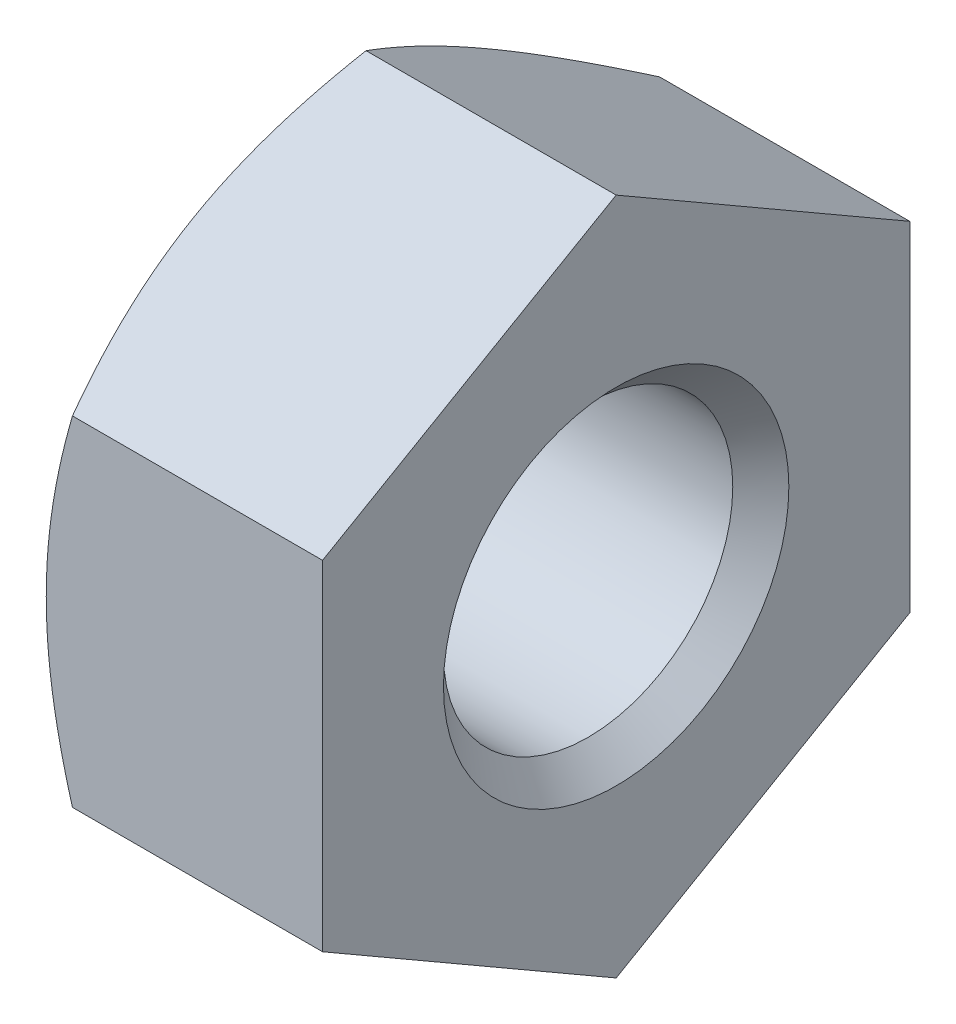
ISO-10303-21;
HEADER;
FILE_DESCRIPTION(('STEP AP214'),'2;1');
FILE_NAME('part.step','',(''),(''),'','','');
FILE_SCHEMA(('AUTOMOTIVE_DESIGN { 1 0 10303 214 1 1 1 1 }'));
ENDSEC;
DATA;
#1=APPLICATION_CONTEXT('core data for automotive mechanical design processes');
#2=APPLICATION_PROTOCOL_DEFINITION('international standard','automotive_design',2000,#1);
#3=PRODUCT_CONTEXT('',#1,'mechanical');
#4=PRODUCT('Part','Part','',(#3));
#5=PRODUCT_RELATED_PRODUCT_CATEGORY('part','',(#4));
#6=PRODUCT_DEFINITION_FORMATION('','',#4);
#7=PRODUCT_DEFINITION_CONTEXT('part definition',#1,'design');
#8=PRODUCT_DEFINITION('design','',#6,#7);
#9=PRODUCT_DEFINITION_SHAPE('','',#8);
#10=(LENGTH_UNIT() NAMED_UNIT(*) SI_UNIT(.MILLI.,.METRE.));
#11=(NAMED_UNIT(*) PLANE_ANGLE_UNIT() SI_UNIT($,.RADIAN.));
#12=(NAMED_UNIT(*) SI_UNIT($,.STERADIAN.) SOLID_ANGLE_UNIT());
#13=UNCERTAINTY_MEASURE_WITH_UNIT(LENGTH_MEASURE(1.E-05),#10,'distance_accuracy_value','');
#14=(GEOMETRIC_REPRESENTATION_CONTEXT(3) GLOBAL_UNCERTAINTY_ASSIGNED_CONTEXT((#13)) GLOBAL_UNIT_ASSIGNED_CONTEXT((#10,
#11,#12)) REPRESENTATION_CONTEXT('',''));
#15=CARTESIAN_POINT('',(0.,0.,0.));
#16=DIRECTION('',(0.,0.,1.));
#17=DIRECTION('',(1.,0.,0.));
#18=AXIS2_PLACEMENT_3D('',#15,#16,#17);
#19=CARTESIAN_POINT('',(0.,0.,0.));
#20=DIRECTION('',(-1.,0.,0.));
#21=DIRECTION('',(0.,0.,1.));
#22=AXIS2_PLACEMENT_3D('',#19,#20,#21);
#23=CONICAL_SURFACE('',#22,5.0000000000523,0.785398163397448);
#24=CARTESIAN_POINT('',(0.,0.,0.));
#25=DIRECTION('',(-1.,0.,0.));
#26=DIRECTION('',(0.,0.,1.));
#27=AXIS2_PLACEMENT_3D('',#24,#25,#26);
#28=CIRCLE('',#27,5.0000000000523);
#29=CARTESIAN_POINT('',(0.,0.,5.0000000000523));
#30=VERTEX_POINT('',#29);
#31=EDGE_CURVE('E21',#30,#30,#28,.T.);
#32=ORIENTED_EDGE('',*,*,#31,.T.);
#33=EDGE_LOOP('',(#32));
#34=FACE_BOUND('',#33,.T.);
#35=CARTESIAN_POINT('',(0.811999999999993,0.,0.));
#36=DIRECTION('',(-1.,0.,0.));
#37=DIRECTION('',(0.,0.,1.));
#38=AXIS2_PLACEMENT_3D('',#35,#36,#37);
#39=CIRCLE('',#38,4.188);
#40=CARTESIAN_POINT('',(0.811999999999993,0.,4.188));
#41=VERTEX_POINT('',#40);
#42=EDGE_CURVE('E106',#41,#41,#39,.F.);
#43=ORIENTED_EDGE('',*,*,#42,.T.);
#44=EDGE_LOOP('',(#43));
#45=FACE_BOUND('',#44,.T.);
#46=ADVANCED_FACE('F18',(#34,#45),#23,.F.);
#47=CARTESIAN_POINT('',(0.,0.,0.));
#48=DIRECTION('',(1.,0.,0.));
#49=DIRECTION('',(0.,0.,-1.));
#50=AXIS2_PLACEMENT_3D('',#47,#48,#49);
#51=PLANE('',#50);
#52=ORIENTED_EDGE('',*,*,#31,.F.);
#53=EDGE_LOOP('',(#52));
#54=FACE_BOUND('',#53,.T.);
#55=CARTESIAN_POINT('',(0.,0.,0.));
#56=DIRECTION('',(1.,0.,0.));
#57=DIRECTION('',(0.,1.,0.));
#58=AXIS2_PLACEMENT_3D('',#55,#56,#57);
#59=CIRCLE('',#58,8.5);
#60=CARTESIAN_POINT('',(0.,0.,-8.49999999999995));
#61=VERTEX_POINT('',#60);
#62=CARTESIAN_POINT('',(0.,7.36121593216772,-4.25000000000009));
#63=VERTEX_POINT('',#62);
#64=EDGE_CURVE('E102',#61,#63,#59,.T.);
#65=ORIENTED_EDGE('',*,*,#64,.F.);
#66=CARTESIAN_POINT('',(0.,0.,0.));
#67=DIRECTION('',(1.,0.,0.));
#68=DIRECTION('',(0.,1.,0.));
#69=AXIS2_PLACEMENT_3D('',#66,#67,#68);
#70=CIRCLE('',#69,8.5);
#71=CARTESIAN_POINT('',(0.,-7.36121593216774,-4.25000000000009));
#72=VERTEX_POINT('',#71);
#73=EDGE_CURVE('E96',#72,#61,#70,.T.);
#74=ORIENTED_EDGE('',*,*,#73,.F.);
#75=CARTESIAN_POINT('',(0.,0.,0.));
#76=DIRECTION('',(1.,0.,0.));
#77=DIRECTION('',(0.,1.,0.));
#78=AXIS2_PLACEMENT_3D('',#75,#76,#77);
#79=CIRCLE('',#78,8.5);
#80=CARTESIAN_POINT('',(0.,-7.36121593216774,4.25000000000009));
#81=VERTEX_POINT('',#80);
#82=EDGE_CURVE('E85',#81,#72,#79,.T.);
#83=ORIENTED_EDGE('',*,*,#82,.F.);
#84=CARTESIAN_POINT('',(0.,0.,0.));
#85=DIRECTION('',(1.,0.,0.));
#86=DIRECTION('',(0.,1.,0.));
#87=AXIS2_PLACEMENT_3D('',#84,#85,#86);
#88=CIRCLE('',#87,8.5);
#89=CARTESIAN_POINT('',(0.,0.,8.49999999999995));
#90=VERTEX_POINT('',#89);
#91=EDGE_CURVE('E95',#90,#81,#88,.T.);
#92=ORIENTED_EDGE('',*,*,#91,.F.);
#93=CARTESIAN_POINT('',(0.,0.,0.));
#94=DIRECTION('',(1.,0.,0.));
#95=DIRECTION('',(0.,1.,0.));
#96=AXIS2_PLACEMENT_3D('',#93,#94,#95);
#97=CIRCLE('',#96,8.5);
#98=CARTESIAN_POINT('',(0.,7.36121593216774,4.25000000000009));
#99=VERTEX_POINT('',#98);
#100=EDGE_CURVE('E447',#99,#90,#97,.T.);
#101=ORIENTED_EDGE('',*,*,#100,.F.);
#102=CARTESIAN_POINT('',(0.,0.,0.));
#103=DIRECTION('',(1.,0.,0.));
#104=DIRECTION('',(0.,1.,0.));
#105=AXIS2_PLACEMENT_3D('',#102,#103,#104);
#106=CIRCLE('',#105,8.5);
#107=EDGE_CURVE('E449',#63,#99,#106,.T.);
#108=ORIENTED_EDGE('',*,*,#107,.F.);
#109=EDGE_LOOP('',(#65,#74,#83,#92,#101,#108));
#110=FACE_BOUND('',#109,.T.);
#111=ADVANCED_FACE('F100',(#54,#110),#51,.F.);
#112=CARTESIAN_POINT('',(7.99999999999999,0.,0.));
#113=DIRECTION('',(-1.,0.,0.));
#114=DIRECTION('',(0.,0.,1.));
#115=AXIS2_PLACEMENT_3D('',#112,#113,#114);
#116=CYLINDRICAL_SURFACE('',#115,4.188);
#117=ORIENTED_EDGE('',*,*,#42,.F.);
#118=EDGE_LOOP('',(#117));
#119=FACE_BOUND('',#118,.T.);
#120=CARTESIAN_POINT('',(7.18800000004194,0.,0.));
#121=DIRECTION('',(1.,0.,0.));
#122=DIRECTION('',(0.,0.,-1.));
#123=AXIS2_PLACEMENT_3D('',#120,#121,#122);
#124=CIRCLE('',#123,4.18799999999919);
#125=CARTESIAN_POINT('',(7.18800000004194,0.,-4.18799999999919));
#126=VERTEX_POINT('',#125);
#127=EDGE_CURVE('E245',#126,#126,#124,.T.);
#128=ORIENTED_EDGE('',*,*,#127,.T.);
#129=EDGE_LOOP('',(#128));
#130=FACE_BOUND('',#129,.T.);
#131=ADVANCED_FACE('F142',(#119,#130),#116,.F.);
#132=CARTESIAN_POINT('',(0.763744514826178,0.,0.));
#133=DIRECTION('',(1.,0.,0.));
#134=DIRECTION('',(0.,1.,0.));
#135=AXIS2_PLACEMENT_3D('',#132,#133,#134);
#136=CONICAL_SURFACE('',#135,9.82284430368098,1.0471975511966);
#137=CARTESIAN_POINT('',(0.,0.,-8.49999999999995));
#138=CARTESIAN_POINT('',(-3.4739183276009E-05,-0.208294880355984,-8.49999999999995));
#139=CARTESIAN_POINT('',(0.00441964379697437,-0.416579726441358,-8.49999999999995));
#140=CARTESIAN_POINT('',(0.022048454738057,-0.832740448360074,-8.49999999999995));
#141=CARTESIAN_POINT('',(0.0352211564053273,-1.04061639698708,-8.49999999999995));
#142=CARTESIAN_POINT('',(0.0699416637352316,-1.4546166103346,-8.49999999999995));
#143=CARTESIAN_POINT('',(0.0914473072514179,-1.66074443821211,-8.49999999999995));
#144=CARTESIAN_POINT('',(0.142371103659139,-2.07201802968812,-8.49999999999995));
#145=CARTESIAN_POINT('',(0.171789464819417,-2.27716376729257,-8.49999999999995));
#146=CARTESIAN_POINT('',(0.271004814168306,-2.89027749857134,-8.49999999999995));
#147=CARTESIAN_POINT('',(0.351810244411298,-3.2964643738834,-8.49999999999995));
#148=CARTESIAN_POINT('',(0.538168234472158,-4.10534509574867,-8.49999999999995));
#149=CARTESIAN_POINT('',(0.643844385729239,-4.50801072781286,-8.49999999999995));
#150=CARTESIAN_POINT('',(0.759189378554848,-4.90747728811182,-8.49999999999995));
#151=B_SPLINE_CURVE_WITH_KNOTS('',3,(#137,#138,#139,#140,#141,#142,#143,#144,#145,#146,#147,
#148,#149,#150),.UNSPECIFIED.,.F.,.F.,(4,2,2,2,2,2,4),(0.,0.624820870450639,1.24951805860457,
1.87109489585109,2.4926880950737,3.73424531091525,4.9821076301794),.UNSPECIFIED.);
#152=CARTESIAN_POINT('',(0.759189378554848,-4.90747728811182,-8.49999999999995));
#153=VERTEX_POINT('',#152);
#154=EDGE_CURVE('E117',#61,#153,#151,.T.);
#155=ORIENTED_EDGE('',*,*,#154,.T.);
#156=CARTESIAN_POINT('',(0.759189378554848,-4.90747728811182,-8.49999999999995));
#157=CARTESIAN_POINT('',(0.64384438572925,-5.10721056826131,-8.15405181081868));
#158=CARTESIAN_POINT('',(0.538168234472175,-5.30854338429341,-7.80533314422018));
#159=CARTESIAN_POINT('',(0.351810244411324,-5.71298374522604,-7.10482189045339));
#160=CARTESIAN_POINT('',(0.271004814168335,-5.91607718288206,-6.75305373774933));
#161=CARTESIAN_POINT('',(0.171789464819448,-6.22263404852144,-6.22208167105285));
#162=CARTESIAN_POINT('',(0.142371103659171,-6.32520691732366,-6.0444202508093));
#163=CARTESIAN_POINT('',(0.0914473072514496,-6.53084371306166,-5.68824687268543));
#164=CARTESIAN_POINT('',(0.0699416637352622,-6.63390762700042,-5.5097349373166));
#165=CARTESIAN_POINT('',(0.0352211564053588,-6.84090773367417,-5.15120023538548));
#166=CARTESIAN_POINT('',(0.0220484547380906,-6.94484570798766,-4.97117438303871));
#167=CARTESIAN_POINT('',(0.0044196437970021,-7.15292606894703,-4.61076862579984));
#168=CARTESIAN_POINT('',(-3.47391832562963E-05,-7.25706849198972,-4.43038865786659));
#169=CARTESIAN_POINT('',(0.,-7.36121593216774,-4.25000000000009));
#170=B_SPLINE_CURVE_WITH_KNOTS('',3,(#156,#157,#158,#159,#160,#161,#162,#163,#164,#165,#166,
#167,#168,#169),.UNSPECIFIED.,.F.,.F.,(4,2,2,2,2,2,4),(0.,1.24786231926412,2.48941953510564,
3.11101273432823,3.73258957157474,4.35728675972866,4.98210763017928),.UNSPECIFIED.);
#171=EDGE_CURVE('E111',#153,#72,#170,.T.);
#172=ORIENTED_EDGE('',*,*,#171,.T.);
#173=ORIENTED_EDGE('',*,*,#73,.T.);
#174=EDGE_LOOP('',(#155,#172,#173));
#175=FACE_BOUND('',#174,.T.);
#176=ADVANCED_FACE('F116',(#175),#136,.T.);
#177=CARTESIAN_POINT('',(0.763744514826178,0.,0.));
#178=DIRECTION('',(1.,0.,0.));
#179=DIRECTION('',(0.,1.,0.));
#180=AXIS2_PLACEMENT_3D('',#177,#178,#179);
#181=CONICAL_SURFACE('',#180,9.82284430368098,1.0471975511966);
#182=CARTESIAN_POINT('',(0.,-7.36121593216774,-4.25000000000009));
#183=CARTESIAN_POINT('',(-3.47391832595689E-05,-7.4653633723457,-4.06961134213355));
#184=CARTESIAN_POINT('',(0.00441964379699695,-7.56950579538838,-3.88923137420027));
#185=CARTESIAN_POINT('',(0.0220484547380831,-7.77758615634773,-3.52882561696138));
#186=CARTESIAN_POINT('',(0.0352211564053507,-7.88152413066124,-3.34879976461461));
#187=CARTESIAN_POINT('',(0.069941663735253,-8.088524237335,-2.99026506268348));
#188=CARTESIAN_POINT('',(0.0914473072514398,-8.19158815127376,-2.81175312731464));
#189=CARTESIAN_POINT('',(0.14237110365916,-8.39722494701176,-2.45557974919075));
#190=CARTESIAN_POINT('',(0.171789464819437,-8.49979781581399,-2.2779183289472));
#191=CARTESIAN_POINT('',(0.271004814168326,-8.80635468145338,-1.74694626225071));
#192=CARTESIAN_POINT('',(0.351810244411319,-9.00944811910942,-1.39517810954663));
#193=CARTESIAN_POINT('',(0.538168234472175,-9.41388848004206,-0.694666855779807));
#194=CARTESIAN_POINT('',(0.643844385729251,-9.61522129607416,-0.345948189181293));
#195=CARTESIAN_POINT('',(0.759189378554848,-9.81495457622364,0.));
#196=B_SPLINE_CURVE_WITH_KNOTS('',3,(#182,#183,#184,#185,#186,#187,#188,#189,#190,#191,#192,
#193,#194,#195),.UNSPECIFIED.,.F.,.F.,(4,2,2,2,2,2,4),(0.,0.624820870450647,1.24951805860458,
1.87109489585111,2.49268809507373,3.73424531091529,4.98210763017946),.UNSPECIFIED.);
#197=CARTESIAN_POINT('',(0.759189378554848,-9.81495457622364,0.));
#198=VERTEX_POINT('',#197);
#199=EDGE_CURVE('E89',#72,#198,#196,.T.);
#200=ORIENTED_EDGE('',*,*,#199,.T.);
#201=CARTESIAN_POINT('',(0.759189378554848,-9.81495457622364,0.));
#202=CARTESIAN_POINT('',(0.643844385729244,-9.61522129607414,0.345948189181283));
#203=CARTESIAN_POINT('',(0.538168234472165,-9.41388848004204,0.694666855779793));
#204=CARTESIAN_POINT('',(0.351810244411305,-9.00944811910939,1.39517810954662));
#205=CARTESIAN_POINT('',(0.271004814168312,-8.80635468145336,1.74694626225069));
#206=CARTESIAN_POINT('',(0.171789464819423,-8.49979781581397,2.27791832894718));
#207=CARTESIAN_POINT('',(0.142371103659145,-8.39722494701174,2.45557974919074));
#208=CARTESIAN_POINT('',(0.0914473072514247,-8.19158815127374,2.81175312731463));
#209=CARTESIAN_POINT('',(0.0699416637352389,-8.08852423733498,2.99026506268346));
#210=CARTESIAN_POINT('',(0.0352211564053362,-7.88152413066122,3.34879976461459));
#211=CARTESIAN_POINT('',(0.0220484547380669,-7.77758615634771,3.52882561696137));
#212=CARTESIAN_POINT('',(0.004419643796983,-7.56950579538836,3.88923137420026));
#213=CARTESIAN_POINT('',(-3.47391832698092E-05,-7.46536337234569,4.06961134213354));
#214=CARTESIAN_POINT('',(0.,-7.36121593216774,4.25000000000009));
#215=B_SPLINE_CURVE_WITH_KNOTS('',3,(#201,#202,#203,#204,#205,#206,#207,#208,#209,#210,#211,
#212,#213,#214),.UNSPECIFIED.,.F.,.F.,(4,2,2,2,2,2,4),(0.,1.24786231926417,2.48941953510573,
3.11101273432835,3.73258957157488,4.35728675972882,4.98210763017947),.UNSPECIFIED.);
#216=EDGE_CURVE('E91',#198,#81,#215,.T.);
#217=ORIENTED_EDGE('',*,*,#216,.T.);
#218=ORIENTED_EDGE('',*,*,#82,.T.);
#219=EDGE_LOOP('',(#200,#217,#218));
#220=FACE_BOUND('',#219,.T.);
#221=ADVANCED_FACE('F87',(#220),#181,.T.);
#222=CARTESIAN_POINT('',(0.763744514826178,0.,0.));
#223=DIRECTION('',(1.,0.,0.));
#224=DIRECTION('',(0.,1.,0.));
#225=AXIS2_PLACEMENT_3D('',#222,#223,#224);
#226=CONICAL_SURFACE('',#225,9.82284430368098,1.0471975511966);
#227=CARTESIAN_POINT('',(0.,-7.36121593216774,4.25000000000009));
#228=CARTESIAN_POINT('',(-3.47391832658052E-05,-7.25706849198971,4.43038865786658));
#229=CARTESIAN_POINT('',(0.00441964379698888,-7.152926068947,4.61076862579983));
#230=CARTESIAN_POINT('',(0.022048454738075,-6.94484570798764,4.9711743830387));
#231=CARTESIAN_POINT('',(0.0352211564053444,-6.84090773367414,5.15120023538547));
#232=CARTESIAN_POINT('',(0.0699416637352487,-6.63390762700039,5.50973493731659));
#233=CARTESIAN_POINT('',(0.0914473072514357,-6.53084371306164,5.68824687268542));
#234=CARTESIAN_POINT('',(0.142371103659157,-6.32520691732364,6.04442025080929));
#235=CARTESIAN_POINT('',(0.171789464819434,-6.22263404852141,6.22208167105284));
#236=CARTESIAN_POINT('',(0.271004814168321,-5.91607718288203,6.75305373774932));
#237=CARTESIAN_POINT('',(0.35181024441131,-5.71298374522601,7.10482189045338));
#238=CARTESIAN_POINT('',(0.538168234472163,-5.30854338429338,7.80533314422018));
#239=CARTESIAN_POINT('',(0.643844385729241,-5.10721056826129,8.15405181081868));
#240=CARTESIAN_POINT('',(0.759189378554848,-4.90747728811182,8.49999999999995));
#241=B_SPLINE_CURVE_WITH_KNOTS('',3,(#227,#228,#229,#230,#231,#232,#233,#234,#235,#236,#237,
#238,#239,#240),.UNSPECIFIED.,.F.,.F.,(4,2,2,2,2,2,4),(0.,0.624820870450626,1.24951805860454,
1.87109489585105,2.49268809507364,3.73424531091516,4.98210763017928),.UNSPECIFIED.);
#242=CARTESIAN_POINT('',(0.759189378554848,-4.90747728811182,8.49999999999995));
#243=VERTEX_POINT('',#242);
#244=EDGE_CURVE('E237',#81,#243,#241,.T.);
#245=ORIENTED_EDGE('',*,*,#244,.T.);
#246=CARTESIAN_POINT('',(0.759189378554848,-4.90747728811182,8.49999999999995));
#247=CARTESIAN_POINT('',(0.643844385729239,-4.50801072781286,8.49999999999995));
#248=CARTESIAN_POINT('',(0.538168234472158,-4.10534509574867,8.49999999999995));
#249=CARTESIAN_POINT('',(0.351810244411298,-3.2964643738834,8.49999999999995));
#250=CARTESIAN_POINT('',(0.271004814168306,-2.89027749857134,8.49999999999995));
#251=CARTESIAN_POINT('',(0.171789464819417,-2.27716376729257,8.49999999999995));
#252=CARTESIAN_POINT('',(0.142371103659139,-2.07201802968812,8.49999999999995));
#253=CARTESIAN_POINT('',(0.0914473072514178,-1.66074443821211,8.49999999999995));
#254=CARTESIAN_POINT('',(0.0699416637352316,-1.4546166103346,8.49999999999995));
#255=CARTESIAN_POINT('',(0.0352211564053273,-1.04061639698708,8.49999999999995));
#256=CARTESIAN_POINT('',(0.022048454738057,-0.832740448360074,8.49999999999995));
#257=CARTESIAN_POINT('',(0.00441964379697439,-0.416579726441358,8.49999999999995));
#258=CARTESIAN_POINT('',(-3.47391832759914E-05,-0.208294880355984,8.49999999999995));
#259=CARTESIAN_POINT('',(0.,0.,8.49999999999995));
#260=B_SPLINE_CURVE_WITH_KNOTS('',3,(#246,#247,#248,#249,#250,#251,#252,#253,#254,#255,#256,
#257,#258,#259),.UNSPECIFIED.,.F.,.F.,(4,2,2,2,2,2,4),(0.,1.24786231926415,2.4894195351057,
3.11101273432831,3.73258957157483,4.35728675972876,4.9821076301794),.UNSPECIFIED.);
#261=EDGE_CURVE('E227',#243,#90,#260,.T.);
#262=ORIENTED_EDGE('',*,*,#261,.T.);
#263=ORIENTED_EDGE('',*,*,#91,.T.);
#264=EDGE_LOOP('',(#245,#262,#263));
#265=FACE_BOUND('',#264,.T.);
#266=ADVANCED_FACE('F205',(#265),#226,.T.);
#267=CARTESIAN_POINT('',(0.763744514826178,0.,0.));
#268=DIRECTION('',(1.,0.,0.));
#269=DIRECTION('',(0.,1.,0.));
#270=AXIS2_PLACEMENT_3D('',#267,#268,#269);
#271=CONICAL_SURFACE('',#270,9.82284430368098,1.0471975511966);
#272=CARTESIAN_POINT('',(0.759189378554848,4.90747728811182,8.49999999999995));
#273=CARTESIAN_POINT('',(0.64384438572925,5.10721056826131,8.15405181081868));
#274=CARTESIAN_POINT('',(0.538168234472175,5.30854338429341,7.80533314422018));
#275=CARTESIAN_POINT('',(0.351810244411324,5.71298374522604,7.10482189045339));
#276=CARTESIAN_POINT('',(0.271004814168335,5.91607718288206,6.75305373774933));
#277=CARTESIAN_POINT('',(0.171789464819448,6.22263404852144,6.22208167105285));
#278=CARTESIAN_POINT('',(0.142371103659171,6.32520691732366,6.0444202508093));
#279=CARTESIAN_POINT('',(0.0914473072514496,6.53084371306166,5.68824687268543));
#280=CARTESIAN_POINT('',(0.0699416637352622,6.63390762700042,5.5097349373166));
#281=CARTESIAN_POINT('',(0.0352211564053588,6.84090773367417,5.15120023538548));
#282=CARTESIAN_POINT('',(0.0220484547380906,6.94484570798766,4.97117438303871));
#283=CARTESIAN_POINT('',(0.00441964379700209,7.15292606894703,4.61076862579984));
#284=CARTESIAN_POINT('',(-3.47391832563109E-05,7.25706849198972,4.43038865786659));
#285=CARTESIAN_POINT('',(0.,7.36121593216774,4.25000000000009));
#286=B_SPLINE_CURVE_WITH_KNOTS('',3,(#272,#273,#274,#275,#276,#277,#278,#279,#280,#281,#282,
#283,#284,#285),.UNSPECIFIED.,.F.,.F.,(4,2,2,2,2,2,4),(0.,1.24786231926412,2.48941953510564,
3.11101273432823,3.73258957157474,4.35728675972866,4.98210763017928),.UNSPECIFIED.);
#287=CARTESIAN_POINT('',(0.759189378554848,4.90747728811182,8.49999999999995));
#288=VERTEX_POINT('',#287);
#289=EDGE_CURVE('E215',#288,#99,#286,.T.);
#290=ORIENTED_EDGE('',*,*,#289,.T.);
#291=ORIENTED_EDGE('',*,*,#100,.T.);
#292=CARTESIAN_POINT('',(0.,0.,8.49999999999995));
#293=CARTESIAN_POINT('',(-3.4739183276009E-05,0.208294880355984,8.49999999999995));
#294=CARTESIAN_POINT('',(0.00441964379697437,0.416579726441358,8.49999999999995));
#295=CARTESIAN_POINT('',(0.022048454738057,0.832740448360074,8.49999999999995));
#296=CARTESIAN_POINT('',(0.0352211564053273,1.04061639698708,8.49999999999995));
#297=CARTESIAN_POINT('',(0.0699416637352316,1.4546166103346,8.49999999999995));
#298=CARTESIAN_POINT('',(0.0914473072514179,1.66074443821211,8.49999999999995));
#299=CARTESIAN_POINT('',(0.142371103659139,2.07201802968812,8.49999999999995));
#300=CARTESIAN_POINT('',(0.171789464819417,2.27716376729257,8.49999999999995));
#301=CARTESIAN_POINT('',(0.271004814168306,2.89027749857134,8.49999999999995));
#302=CARTESIAN_POINT('',(0.351810244411298,3.2964643738834,8.49999999999995));
#303=CARTESIAN_POINT('',(0.538168234472158,4.10534509574867,8.49999999999995));
#304=CARTESIAN_POINT('',(0.643844385729239,4.50801072781286,8.49999999999995));
#305=CARTESIAN_POINT('',(0.759189378554848,4.90747728811182,8.49999999999995));
#306=B_SPLINE_CURVE_WITH_KNOTS('',3,(#292,#293,#294,#295,#296,#297,#298,#299,#300,#301,#302,
#303,#304,#305),.UNSPECIFIED.,.F.,.F.,(4,2,2,2,2,2,4),(0.,0.624820870450639,1.24951805860457,
1.87109489585109,2.4926880950737,3.73424531091525,4.9821076301794),.UNSPECIFIED.);
#307=EDGE_CURVE('E210',#90,#288,#306,.T.);
#308=ORIENTED_EDGE('',*,*,#307,.T.);
#309=EDGE_LOOP('',(#290,#291,#308));
#310=FACE_BOUND('',#309,.T.);
#311=ADVANCED_FACE('F198',(#310),#271,.T.);
#312=CARTESIAN_POINT('',(0.763744514826178,0.,0.));
#313=DIRECTION('',(1.,0.,0.));
#314=DIRECTION('',(0.,1.,0.));
#315=AXIS2_PLACEMENT_3D('',#312,#313,#314);
#316=CONICAL_SURFACE('',#315,9.82284430368098,1.0471975511966);
#317=ORIENTED_EDGE('',*,*,#107,.T.);
#318=CARTESIAN_POINT('',(0.,7.36121593216774,4.25000000000009));
#319=CARTESIAN_POINT('',(-3.47391832595776E-05,7.4653633723457,4.06961134213355));
#320=CARTESIAN_POINT('',(0.00441964379699692,7.56950579538838,3.88923137420027));
#321=CARTESIAN_POINT('',(0.022048454738083,7.77758615634773,3.52882561696138));
#322=CARTESIAN_POINT('',(0.0352211564053507,7.88152413066124,3.34879976461461));
#323=CARTESIAN_POINT('',(0.069941663735253,8.088524237335,2.99026506268348));
#324=CARTESIAN_POINT('',(0.0914473072514398,8.19158815127376,2.81175312731464));
#325=CARTESIAN_POINT('',(0.142371103659161,8.39722494701176,2.45557974919075));
#326=CARTESIAN_POINT('',(0.171789464819437,8.49979781581399,2.2779183289472));
#327=CARTESIAN_POINT('',(0.271004814168326,8.80635468145338,1.74694626225071));
#328=CARTESIAN_POINT('',(0.351810244411319,9.00944811910942,1.39517810954663));
#329=CARTESIAN_POINT('',(0.538168234472175,9.41388848004206,0.694666855779807));
#330=CARTESIAN_POINT('',(0.643844385729251,9.61522129607416,0.345948189181293));
#331=CARTESIAN_POINT('',(0.759189378554848,9.81495457622364,0.));
#332=B_SPLINE_CURVE_WITH_KNOTS('',3,(#318,#319,#320,#321,#322,#323,#324,#325,#326,#327,#328,
#329,#330,#331),.UNSPECIFIED.,.F.,.F.,(4,2,2,2,2,2,4),(0.,0.624820870450647,1.24951805860458,
1.87109489585111,2.49268809507373,3.73424531091529,4.98210763017946),.UNSPECIFIED.);
#333=CARTESIAN_POINT('',(0.759189378554848,9.81495457622364,0.));
#334=VERTEX_POINT('',#333);
#335=EDGE_CURVE('E188',#99,#334,#332,.T.);
#336=ORIENTED_EDGE('',*,*,#335,.T.);
#337=CARTESIAN_POINT('',(0.759189378554848,9.81495457622364,0.));
#338=CARTESIAN_POINT('',(0.643844385729242,9.61522129607414,-0.345948189181283));
#339=CARTESIAN_POINT('',(0.538168234472162,9.41388848004204,-0.694666855779793));
#340=CARTESIAN_POINT('',(0.351810244411304,9.00944811910939,-1.39517810954662));
#341=CARTESIAN_POINT('',(0.271004814168312,8.80635468145336,-1.74694626225069));
#342=CARTESIAN_POINT('',(0.171789464819423,8.49979781581397,-2.27791832894718));
#343=CARTESIAN_POINT('',(0.142371103659145,8.39722494701174,-2.45557974919074));
#344=CARTESIAN_POINT('',(0.091447307251424,8.19158815127374,-2.81175312731463));
#345=CARTESIAN_POINT('',(0.069941663735238,8.08852423733498,-2.99026506268347));
#346=CARTESIAN_POINT('',(0.0352211564053353,7.88152413066121,-3.3487997646146));
#347=CARTESIAN_POINT('',(0.0220484547380663,7.7775861563477,-3.52882561696138));
#348=CARTESIAN_POINT('',(0.00441964379698282,7.56950579538835,-3.88923137420027));
#349=CARTESIAN_POINT('',(-3.47391832697801E-05,7.46536337234568,-4.06961134213354));
#350=CARTESIAN_POINT('',(0.,7.36121593216772,-4.25000000000009));
#351=B_SPLINE_CURVE_WITH_KNOTS('',3,(#337,#338,#339,#340,#341,#342,#343,#344,#345,#346,#347,
#348,#349,#350),.UNSPECIFIED.,.F.,.F.,(4,2,2,2,2,2,4),(0.,1.24786231926417,2.48941953510574,
3.11101273432835,3.73258957157489,4.35728675972882,4.98210763017947),.UNSPECIFIED.);
#352=EDGE_CURVE('E181',#334,#63,#351,.T.);
#353=ORIENTED_EDGE('',*,*,#352,.T.);
#354=EDGE_LOOP('',(#317,#336,#353));
#355=FACE_BOUND('',#354,.T.);
#356=ADVANCED_FACE('F193',(#355),#316,.T.);
#357=CARTESIAN_POINT('',(0.763744514826178,0.,0.));
#358=DIRECTION('',(1.,0.,0.));
#359=DIRECTION('',(0.,1.,0.));
#360=AXIS2_PLACEMENT_3D('',#357,#358,#359);
#361=CONICAL_SURFACE('',#360,9.82284430368098,1.0471975511966);
#362=CARTESIAN_POINT('',(0.,7.36121593216772,-4.25000000000009));
#363=CARTESIAN_POINT('',(-3.47391832662213E-05,7.2570684919897,-4.43038865786658));
#364=CARTESIAN_POINT('',(0.00441964379698838,7.152926068947,-4.61076862579984));
#365=CARTESIAN_POINT('',(0.0220484547380746,6.94484570798764,-4.9711743830387));
#366=CARTESIAN_POINT('',(0.0352211564053443,6.84090773367414,-5.15120023538548));
#367=CARTESIAN_POINT('',(0.069941663735249,6.63390762700039,-5.5097349373166));
#368=CARTESIAN_POINT('',(0.0914473072514363,6.53084371306163,-5.68824687268542));
#369=CARTESIAN_POINT('',(0.142371103659158,6.32520691732364,-6.0444202508093));
#370=CARTESIAN_POINT('',(0.171789464819435,6.22263404852141,-6.22208167105285));
#371=CARTESIAN_POINT('',(0.271004814168322,5.91607718288203,-6.75305373774932));
#372=CARTESIAN_POINT('',(0.35181024441131,5.71298374522601,-7.10482189045338));
#373=CARTESIAN_POINT('',(0.538168234472164,5.30854338429338,-7.80533314422018));
#374=CARTESIAN_POINT('',(0.643844385729241,5.10721056826129,-8.15405181081868));
#375=CARTESIAN_POINT('',(0.759189378554848,4.90747728811182,-8.49999999999995));
#376=B_SPLINE_CURVE_WITH_KNOTS('',3,(#362,#363,#364,#365,#366,#367,#368,#369,#370,#371,#372,
#373,#374,#375),.UNSPECIFIED.,.F.,.F.,(4,2,2,2,2,2,4),(0.,0.624820870450625,1.24951805860453,
1.87109489585104,2.49268809507364,3.73424531091515,4.98210763017927),.UNSPECIFIED.);
#377=CARTESIAN_POINT('',(0.759189378554848,4.90747728811182,-8.49999999999995));
#378=VERTEX_POINT('',#377);
#379=EDGE_CURVE('E174',#63,#378,#376,.T.);
#380=ORIENTED_EDGE('',*,*,#379,.T.);
#381=CARTESIAN_POINT('',(0.759189378554848,4.90747728811182,-8.49999999999995));
#382=CARTESIAN_POINT('',(0.643844385729239,4.50801072781286,-8.49999999999995));
#383=CARTESIAN_POINT('',(0.538168234472158,4.10534509574867,-8.49999999999995));
#384=CARTESIAN_POINT('',(0.351810244411298,3.2964643738834,-8.49999999999995));
#385=CARTESIAN_POINT('',(0.271004814168306,2.89027749857134,-8.49999999999995));
#386=CARTESIAN_POINT('',(0.171789464819417,2.27716376729257,-8.49999999999995));
#387=CARTESIAN_POINT('',(0.142371103659139,2.07201802968812,-8.49999999999995));
#388=CARTESIAN_POINT('',(0.0914473072514178,1.66074443821211,-8.49999999999995));
#389=CARTESIAN_POINT('',(0.0699416637352316,1.4546166103346,-8.49999999999995));
#390=CARTESIAN_POINT('',(0.0352211564053273,1.04061639698708,-8.49999999999995));
#391=CARTESIAN_POINT('',(0.022048454738057,0.832740448360074,-8.49999999999995));
#392=CARTESIAN_POINT('',(0.00441964379697439,0.416579726441358,-8.49999999999995));
#393=CARTESIAN_POINT('',(-3.47391832759914E-05,0.208294880355984,-8.49999999999995));
#394=CARTESIAN_POINT('',(0.,0.,-8.49999999999995));
#395=B_SPLINE_CURVE_WITH_KNOTS('',3,(#381,#382,#383,#384,#385,#386,#387,#388,#389,#390,#391,
#392,#393,#394),.UNSPECIFIED.,.F.,.F.,(4,2,2,2,2,2,4),(0.,1.24786231926415,2.4894195351057,
3.11101273432831,3.73258957157483,4.35728675972876,4.9821076301794),.UNSPECIFIED.);
#396=EDGE_CURVE('E248',#378,#61,#395,.T.);
#397=ORIENTED_EDGE('',*,*,#396,.T.);
#398=ORIENTED_EDGE('',*,*,#64,.T.);
#399=EDGE_LOOP('',(#380,#397,#398));
#400=FACE_BOUND('',#399,.T.);
#401=ADVANCED_FACE('F197',(#400),#361,.T.);
#402=CARTESIAN_POINT('',(8.0000000000382,0.,0.));
#403=DIRECTION('',(1.,0.,0.));
#404=DIRECTION('',(0.,0.,-1.));
#405=AXIS2_PLACEMENT_3D('',#402,#403,#404);
#406=CONICAL_SURFACE('',#405,5.0000000000523,0.785398163397448);
#407=ORIENTED_EDGE('',*,*,#127,.F.);
#408=EDGE_LOOP('',(#407));
#409=FACE_BOUND('',#408,.T.);
#410=CARTESIAN_POINT('',(8.0000000000382,0.,0.));
#411=DIRECTION('',(1.,0.,0.));
#412=DIRECTION('',(0.,0.,-1.));
#413=AXIS2_PLACEMENT_3D('',#410,#411,#412);
#414=CIRCLE('',#413,5.0000000000523);
#415=CARTESIAN_POINT('',(8.0000000000382,0.,-5.0000000000523));
#416=VERTEX_POINT('',#415);
#417=EDGE_CURVE('E255',#416,#416,#414,.T.);
#418=ORIENTED_EDGE('',*,*,#417,.T.);
#419=EDGE_LOOP('',(#418));
#420=FACE_BOUND('',#419,.T.);
#421=ADVANCED_FACE('F314',(#409,#420),#406,.F.);
#422=CARTESIAN_POINT('',(9.99999999999999,-4.90747728811182,-8.49999999999995));
#423=DIRECTION('',(0.,0.,1.));
#424=DIRECTION('',(1.,0.,0.));
#425=AXIS2_PLACEMENT_3D('',#422,#423,#424);
#426=PLANE('',#425);
#427=ORIENTED_EDGE('',*,*,#154,.F.);
#428=ORIENTED_EDGE('',*,*,#396,.F.);
#429=DIRECTION('',(1.,0.,0.));
#430=VECTOR('',#429,1.);
#431=CARTESIAN_POINT('',(9.99999999999999,4.90747728811182,-8.49999999999995));
#432=LINE('',#431,#430);
#433=CARTESIAN_POINT('',(7.99999999999999,4.90747728811182,-8.49999999999995));
#434=VERTEX_POINT('',#433);
#435=EDGE_CURVE('E281',#378,#434,#432,.T.);
#436=ORIENTED_EDGE('',*,*,#435,.T.);
#437=DIRECTION('',(0.,1.,0.));
#438=VECTOR('',#437,1.);
#439=CARTESIAN_POINT('',(7.99999999999999,11.9,-8.49999999999995));
#440=LINE('',#439,#438);
#441=CARTESIAN_POINT('',(7.99999999999999,-4.90747728811182,-8.49999999999995));
#442=VERTEX_POINT('',#441);
#443=EDGE_CURVE('E251',#434,#442,#440,.F.);
#444=ORIENTED_EDGE('',*,*,#443,.T.);
#445=DIRECTION('',(1.,0.,0.));
#446=VECTOR('',#445,1.);
#447=CARTESIAN_POINT('',(9.99999999999999,-4.90747728811182,-8.49999999999995));
#448=LINE('',#447,#446);
#449=EDGE_CURVE('E118',#442,#153,#448,.F.);
#450=ORIENTED_EDGE('',*,*,#449,.T.);
#451=EDGE_LOOP('',(#427,#428,#436,#444,#450));
#452=FACE_BOUND('',#451,.T.);
#453=ADVANCED_FACE('F303',(#452),#426,.F.);
#454=CARTESIAN_POINT('',(9.99999999999999,-9.81495457622364,0.));
#455=DIRECTION('',(0.,0.866025403784439,0.5));
#456=DIRECTION('',(0.,-0.5,0.866025403784439));
#457=AXIS2_PLACEMENT_3D('',#454,#455,#456);
#458=PLANE('',#457);
#459=ORIENTED_EDGE('',*,*,#199,.F.);
#460=ORIENTED_EDGE('',*,*,#171,.F.);
#461=ORIENTED_EDGE('',*,*,#449,.F.);
#462=DIRECTION('',(0.,-0.5,0.866025403784439));
#463=VECTOR('',#462,1.);
#464=CARTESIAN_POINT('',(7.99999999999999,-4.90747728811182,-8.49999999999995));
#465=LINE('',#464,#463);
#466=CARTESIAN_POINT('',(7.99999999999999,-9.81495457622364,0.));
#467=VERTEX_POINT('',#466);
#468=EDGE_CURVE('E254',#442,#467,#465,.T.);
#469=ORIENTED_EDGE('',*,*,#468,.T.);
#470=DIRECTION('',(1.,0.,0.));
#471=VECTOR('',#470,1.);
#472=CARTESIAN_POINT('',(9.99999999999999,-9.81495457622364,0.));
#473=LINE('',#472,#471);
#474=EDGE_CURVE('E114',#467,#198,#473,.F.);
#475=ORIENTED_EDGE('',*,*,#474,.T.);
#476=EDGE_LOOP('',(#459,#460,#461,#469,#475));
#477=FACE_BOUND('',#476,.T.);
#478=ADVANCED_FACE('F110',(#477),#458,.F.);
#479=CARTESIAN_POINT('',(9.99999999999999,-4.90747728811182,8.49999999999995));
#480=DIRECTION('',(0.,0.866025403784439,-0.5));
#481=DIRECTION('',(0.,0.5,0.866025403784439));
#482=AXIS2_PLACEMENT_3D('',#479,#480,#481);
#483=PLANE('',#482);
#484=ORIENTED_EDGE('',*,*,#244,.F.);
#485=ORIENTED_EDGE('',*,*,#216,.F.);
#486=ORIENTED_EDGE('',*,*,#474,.F.);
#487=DIRECTION('',(0.,0.5,0.866025403784439));
#488=VECTOR('',#487,1.);
#489=CARTESIAN_POINT('',(7.99999999999999,-9.81495457622364,0.));
#490=LINE('',#489,#488);
#491=CARTESIAN_POINT('',(7.99999999999999,-4.90747728811182,8.49999999999995));
#492=VERTEX_POINT('',#491);
#493=EDGE_CURVE('E266',#467,#492,#490,.T.);
#494=ORIENTED_EDGE('',*,*,#493,.T.);
#495=DIRECTION('',(-1.,0.,0.));
#496=VECTOR('',#495,1.);
#497=CARTESIAN_POINT('',(9.99999999999999,-4.90747728811182,8.49999999999995));
#498=LINE('',#497,#496);
#499=EDGE_CURVE('E234',#492,#243,#498,.T.);
#500=ORIENTED_EDGE('',*,*,#499,.T.);
#501=EDGE_LOOP('',(#484,#485,#486,#494,#500));
#502=FACE_BOUND('',#501,.T.);
#503=ADVANCED_FACE('F301',(#502),#483,.F.);
#504=CARTESIAN_POINT('',(9.99999999999999,4.90747728811182,8.49999999999995));
#505=DIRECTION('',(0.,0.,-1.));
#506=DIRECTION('',(-1.,0.,0.));
#507=AXIS2_PLACEMENT_3D('',#504,#505,#506);
#508=PLANE('',#507);
#509=ORIENTED_EDGE('',*,*,#307,.F.);
#510=ORIENTED_EDGE('',*,*,#261,.F.);
#511=ORIENTED_EDGE('',*,*,#499,.F.);
#512=DIRECTION('',(0.,1.,0.));
#513=VECTOR('',#512,1.);
#514=CARTESIAN_POINT('',(7.99999999999999,11.9,8.49999999999995));
#515=LINE('',#514,#513);
#516=CARTESIAN_POINT('',(7.99999999999999,4.90747728811182,8.49999999999995));
#517=VERTEX_POINT('',#516);
#518=EDGE_CURVE('E262',#492,#517,#515,.T.);
#519=ORIENTED_EDGE('',*,*,#518,.T.);
#520=DIRECTION('',(1.,0.,0.));
#521=VECTOR('',#520,1.);
#522=CARTESIAN_POINT('',(9.99999999999999,4.90747728811182,8.49999999999995));
#523=LINE('',#522,#521);
#524=EDGE_CURVE('E220',#517,#288,#523,.F.);
#525=ORIENTED_EDGE('',*,*,#524,.T.);
#526=EDGE_LOOP('',(#509,#510,#511,#519,#525));
#527=FACE_BOUND('',#526,.T.);
#528=ADVANCED_FACE('F297',(#527),#508,.F.);
#529=CARTESIAN_POINT('',(9.99999999999999,9.81495457622364,0.));
#530=DIRECTION('',(0.,-0.866025403784439,-0.5));
#531=DIRECTION('',(0.,0.5,-0.866025403784439));
#532=AXIS2_PLACEMENT_3D('',#529,#530,#531);
#533=PLANE('',#532);
#534=ORIENTED_EDGE('',*,*,#335,.F.);
#535=ORIENTED_EDGE('',*,*,#289,.F.);
#536=ORIENTED_EDGE('',*,*,#524,.F.);
#537=DIRECTION('',(0.,0.5,-0.866025403784439));
#538=VECTOR('',#537,1.);
#539=CARTESIAN_POINT('',(7.99999999999999,4.90747728811182,8.49999999999995));
#540=LINE('',#539,#538);
#541=CARTESIAN_POINT('',(7.99999999999999,9.81495457622364,0.));
#542=VERTEX_POINT('',#541);
#543=EDGE_CURVE('E27',#517,#542,#540,.T.);
#544=ORIENTED_EDGE('',*,*,#543,.T.);
#545=DIRECTION('',(1.,0.,0.));
#546=VECTOR('',#545,1.);
#547=CARTESIAN_POINT('',(9.99999999999999,9.81495457622364,0.));
#548=LINE('',#547,#546);
#549=EDGE_CURVE('E35',#542,#334,#548,.F.);
#550=ORIENTED_EDGE('',*,*,#549,.T.);
#551=EDGE_LOOP('',(#534,#535,#536,#544,#550));
#552=FACE_BOUND('',#551,.T.);
#553=ADVANCED_FACE('F164',(#552),#533,.F.);
#554=CARTESIAN_POINT('',(9.99999999999999,4.90747728811182,-8.49999999999995));
#555=DIRECTION('',(0.,-0.866025403784439,0.5));
#556=DIRECTION('',(0.,-0.5,-0.866025403784439));
#557=AXIS2_PLACEMENT_3D('',#554,#555,#556);
#558=PLANE('',#557);
#559=ORIENTED_EDGE('',*,*,#379,.F.);
#560=ORIENTED_EDGE('',*,*,#352,.F.);
#561=ORIENTED_EDGE('',*,*,#549,.F.);
#562=DIRECTION('',(0.,-0.5,-0.866025403784439));
#563=VECTOR('',#562,1.);
#564=CARTESIAN_POINT('',(7.99999999999999,9.81495457622364,0.));
#565=LINE('',#564,#563);
#566=EDGE_CURVE('E11',#542,#434,#565,.T.);
#567=ORIENTED_EDGE('',*,*,#566,.T.);
#568=ORIENTED_EDGE('',*,*,#435,.F.);
#569=EDGE_LOOP('',(#559,#560,#561,#567,#568));
#570=FACE_BOUND('',#569,.T.);
#571=ADVANCED_FACE('F158',(#570),#558,.F.);
#572=CARTESIAN_POINT('',(7.99999999999999,11.9,0.));
#573=DIRECTION('',(-1.,0.,0.));
#574=DIRECTION('',(0.,0.,1.));
#575=AXIS2_PLACEMENT_3D('',#572,#573,#574);
#576=PLANE('',#575);
#577=ORIENTED_EDGE('',*,*,#543,.F.);
#578=ORIENTED_EDGE('',*,*,#518,.F.);
#579=ORIENTED_EDGE('',*,*,#493,.F.);
#580=ORIENTED_EDGE('',*,*,#468,.F.);
#581=ORIENTED_EDGE('',*,*,#443,.F.);
#582=ORIENTED_EDGE('',*,*,#566,.F.);
#583=EDGE_LOOP('',(#577,#578,#579,#580,#581,#582));
#584=FACE_BOUND('',#583,.T.);
#585=ORIENTED_EDGE('',*,*,#417,.F.);
#586=EDGE_LOOP('',(#585));
#587=FACE_BOUND('',#586,.T.);
#588=ADVANCED_FACE('F156',(#584,#587),#576,.F.);
#589=CLOSED_SHELL('',(#46,#111,#131,#176,#221,#266,#311,#356,#401,#421,#453,#478,#503,#528,#553,
#571,#588));
#590=MANIFOLD_SOLID_BREP('B1',#589);
#591=ADVANCED_BREP_SHAPE_REPRESENTATION('',(#18,#590),#14);
#592=SHAPE_DEFINITION_REPRESENTATION(#9,#591);
ENDSEC;
END-ISO-10303-21;
